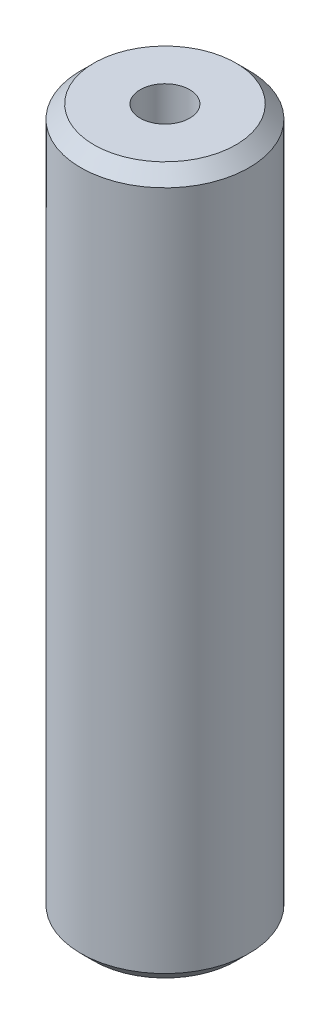
ISO-10303-21;
HEADER;
FILE_DESCRIPTION(('STEP AP214'),'2;1');
FILE_NAME('part.step','',(''),(''),'','','');
FILE_SCHEMA(('AUTOMOTIVE_DESIGN { 1 0 10303 214 1 1 1 1 }'));
ENDSEC;
DATA;
#1=APPLICATION_CONTEXT('core data for automotive mechanical design processes');
#2=APPLICATION_PROTOCOL_DEFINITION('international standard','automotive_design',2000,#1);
#3=PRODUCT_CONTEXT('',#1,'mechanical');
#4=PRODUCT('Part','Part','',(#3));
#5=PRODUCT_RELATED_PRODUCT_CATEGORY('part','',(#4));
#6=PRODUCT_DEFINITION_FORMATION('','',#4);
#7=PRODUCT_DEFINITION_CONTEXT('part definition',#1,'design');
#8=PRODUCT_DEFINITION('design','',#6,#7);
#9=PRODUCT_DEFINITION_SHAPE('','',#8);
#10=(LENGTH_UNIT() NAMED_UNIT(*) SI_UNIT(.MILLI.,.METRE.));
#11=(NAMED_UNIT(*) PLANE_ANGLE_UNIT() SI_UNIT($,.RADIAN.));
#12=(NAMED_UNIT(*) SI_UNIT($,.STERADIAN.) SOLID_ANGLE_UNIT());
#13=UNCERTAINTY_MEASURE_WITH_UNIT(LENGTH_MEASURE(1.E-05),#10,'distance_accuracy_value','');
#14=(GEOMETRIC_REPRESENTATION_CONTEXT(3) GLOBAL_UNCERTAINTY_ASSIGNED_CONTEXT((#13)) GLOBAL_UNIT_ASSIGNED_CONTEXT((#10,
#11,#12)) REPRESENTATION_CONTEXT('',''));
#15=CARTESIAN_POINT('',(0.,0.,0.));
#16=DIRECTION('',(0.,0.,1.));
#17=DIRECTION('',(1.,0.,0.));
#18=AXIS2_PLACEMENT_3D('',#15,#16,#17);
#19=CARTESIAN_POINT('',(0.,126.003839893909,0.));
#20=DIRECTION('',(0.,-1.,0.));
#21=DIRECTION('',(0.,0.,-1.));
#22=AXIS2_PLACEMENT_3D('',#19,#20,#21);
#23=CYLINDRICAL_SURFACE('',#22,15.);
#24=CARTESIAN_POINT('',(0.,123.651379031285,0.));
#25=DIRECTION('',(0.,1.,0.));
#26=DIRECTION('',(0.,0.,1.));
#27=AXIS2_PLACEMENT_3D('',#24,#25,#26);
#28=CIRCLE('',#27,15.);
#29=CARTESIAN_POINT('',(0.,123.651379031285,15.));
#30=VERTEX_POINT('',#29);
#31=EDGE_CURVE('E50',#30,#30,#28,.F.);
#32=ORIENTED_EDGE('',*,*,#31,.T.);
#33=EDGE_LOOP('',(#32));
#34=FACE_BOUND('',#33,.T.);
#35=CARTESIAN_POINT('',(0.,2.35246086262345,0.));
#36=DIRECTION('',(0.,1.,0.));
#37=DIRECTION('',(0.,0.,1.));
#38=AXIS2_PLACEMENT_3D('',#35,#36,#37);
#39=CIRCLE('',#38,15.);
#40=CARTESIAN_POINT('',(0.,2.35246086262345,15.));
#41=VERTEX_POINT('',#40);
#42=EDGE_CURVE('E51',#41,#41,#39,.T.);
#43=ORIENTED_EDGE('',*,*,#42,.T.);
#44=EDGE_LOOP('',(#43));
#45=FACE_BOUND('',#44,.T.);
#46=ADVANCED_FACE('F39',(#34,#45),#23,.T.);
#47=CARTESIAN_POINT('',(0.,126.003839893909,0.));
#48=DIRECTION('',(0.,1.,0.));
#49=DIRECTION('',(0.,0.,1.));
#50=AXIS2_PLACEMENT_3D('',#47,#48,#49);
#51=PLANE('',#50);
#52=CARTESIAN_POINT('',(0.,126.003839893909,0.));
#53=DIRECTION('',(0.,1.,0.));
#54=DIRECTION('',(0.,0.,1.));
#55=AXIS2_PLACEMENT_3D('',#52,#53,#54);
#56=CIRCLE('',#55,12.6475391373766);
#57=CARTESIAN_POINT('',(0.,126.003839893909,12.6475391373766));
#58=VERTEX_POINT('',#57);
#59=EDGE_CURVE('E54',#58,#58,#56,.T.);
#60=ORIENTED_EDGE('',*,*,#59,.T.);
#61=EDGE_LOOP('',(#60));
#62=FACE_BOUND('',#61,.T.);
#63=CARTESIAN_POINT('',(0.,126.003839893909,0.));
#64=DIRECTION('',(0.,1.,0.));
#65=DIRECTION('',(0.,0.,1.));
#66=AXIS2_PLACEMENT_3D('',#63,#64,#65);
#67=CIRCLE('',#66,4.41232141989689);
#68=CARTESIAN_POINT('',(0.,126.003839893909,4.41232141989689));
#69=VERTEX_POINT('',#68);
#70=EDGE_CURVE('E58',#69,#69,#67,.T.);
#71=ORIENTED_EDGE('',*,*,#70,.F.);
#72=EDGE_LOOP('',(#71));
#73=FACE_BOUND('',#72,.T.);
#74=ADVANCED_FACE('F69',(#62,#73),#51,.T.);
#75=CARTESIAN_POINT('',(0.,0.,0.));
#76=DIRECTION('',(0.,1.,0.));
#77=DIRECTION('',(0.,0.,1.));
#78=AXIS2_PLACEMENT_3D('',#75,#76,#77);
#79=PLANE('',#78);
#80=CARTESIAN_POINT('',(0.,0.,0.));
#81=DIRECTION('',(0.,1.,0.));
#82=DIRECTION('',(0.,0.,1.));
#83=AXIS2_PLACEMENT_3D('',#80,#81,#82);
#84=CIRCLE('',#83,12.6475391373765);
#85=CARTESIAN_POINT('',(0.,0.,12.6475391373765));
#86=VERTEX_POINT('',#85);
#87=EDGE_CURVE('E10',#86,#86,#84,.F.);
#88=ORIENTED_EDGE('',*,*,#87,.T.);
#89=EDGE_LOOP('',(#88));
#90=FACE_BOUND('',#89,.T.);
#91=CARTESIAN_POINT('',(0.,0.,0.));
#92=DIRECTION('',(0.,1.,0.));
#93=DIRECTION('',(0.,0.,1.));
#94=AXIS2_PLACEMENT_3D('',#91,#92,#93);
#95=CIRCLE('',#94,4.41232141989689);
#96=CARTESIAN_POINT('',(0.,0.,4.41232141989689));
#97=VERTEX_POINT('',#96);
#98=EDGE_CURVE('E63',#97,#97,#95,.T.);
#99=ORIENTED_EDGE('',*,*,#98,.T.);
#100=EDGE_LOOP('',(#99));
#101=FACE_BOUND('',#100,.T.);
#102=ADVANCED_FACE('F75',(#90,#101),#79,.F.);
#103=CARTESIAN_POINT('',(0.,126.003839893909,0.));
#104=DIRECTION('',(0.,-1.,0.));
#105=DIRECTION('',(0.,0.,-1.));
#106=AXIS2_PLACEMENT_3D('',#103,#104,#105);
#107=CYLINDRICAL_SURFACE('',#106,4.41232141989689);
#108=ORIENTED_EDGE('',*,*,#70,.T.);
#109=EDGE_LOOP('',(#108));
#110=FACE_BOUND('',#109,.T.);
#111=ORIENTED_EDGE('',*,*,#98,.F.);
#112=EDGE_LOOP('',(#111));
#113=FACE_BOUND('',#112,.T.);
#114=ADVANCED_FACE('F70',(#110,#113),#107,.F.);
#115=CARTESIAN_POINT('',(0.,126.003839893909,0.));
#116=DIRECTION('',(0.,-1.,0.));
#117=DIRECTION('',(0.,0.,-1.));
#118=AXIS2_PLACEMENT_3D('',#115,#116,#117);
#119=CONICAL_SURFACE('',#118,12.6475391373766,0.785398163397442);
#120=ORIENTED_EDGE('',*,*,#31,.F.);
#121=EDGE_LOOP('',(#120));
#122=FACE_BOUND('',#121,.T.);
#123=ORIENTED_EDGE('',*,*,#59,.F.);
#124=EDGE_LOOP('',(#123));
#125=FACE_BOUND('',#124,.T.);
#126=ADVANCED_FACE('F81',(#122,#125),#119,.T.);
#127=CARTESIAN_POINT('',(0.,2.35246086262345,0.));
#128=DIRECTION('',(0.,1.,0.));
#129=DIRECTION('',(0.,0.,1.));
#130=AXIS2_PLACEMENT_3D('',#127,#128,#129);
#131=CONICAL_SURFACE('',#130,15.,0.785398163397451);
#132=ORIENTED_EDGE('',*,*,#87,.F.);
#133=EDGE_LOOP('',(#132));
#134=FACE_BOUND('',#133,.T.);
#135=ORIENTED_EDGE('',*,*,#42,.F.);
#136=EDGE_LOOP('',(#135));
#137=FACE_BOUND('',#136,.T.);
#138=ADVANCED_FACE('F45',(#134,#137),#131,.T.);
#139=CLOSED_SHELL('',(#46,#74,#102,#114,#126,#138));
#140=MANIFOLD_SOLID_BREP('B2',#139);
#141=ADVANCED_BREP_SHAPE_REPRESENTATION('',(#18,#140),#14);
#142=SHAPE_DEFINITION_REPRESENTATION(#9,#141);
ENDSEC;
END-ISO-10303-21;
